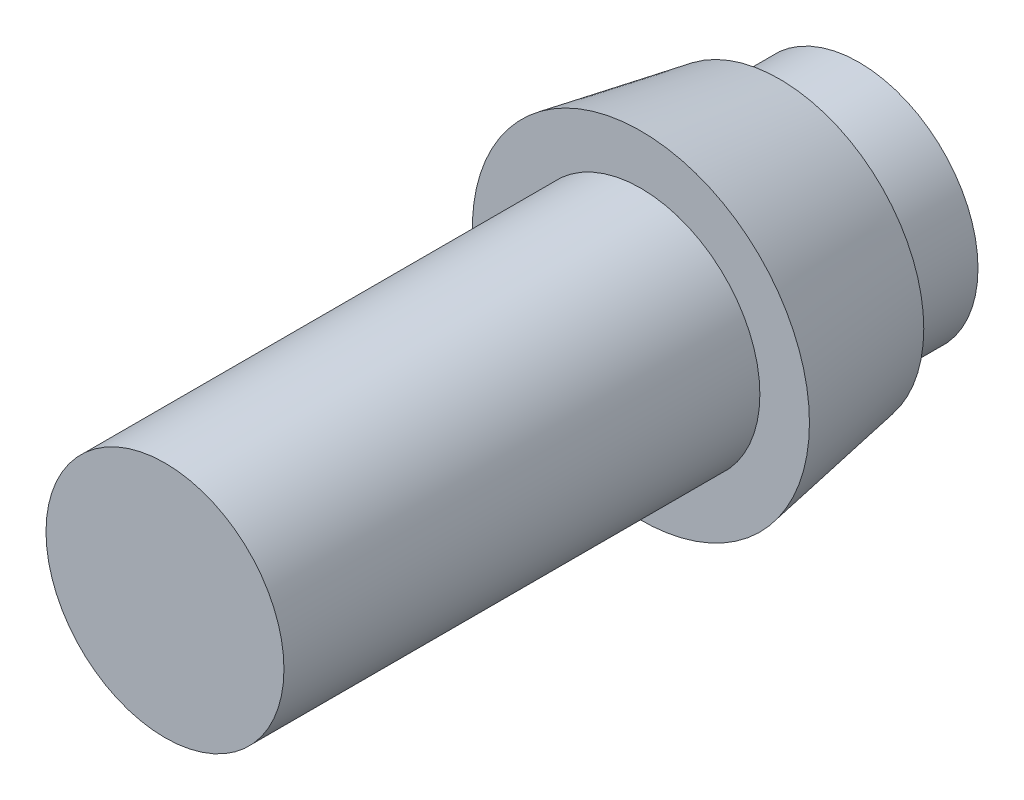
ISO-10303-21;
HEADER;
FILE_DESCRIPTION(('STEP AP214'),'2;1');
FILE_NAME('part.step','',(''),(''),'','','');
FILE_SCHEMA(('AUTOMOTIVE_DESIGN { 1 0 10303 214 1 1 1 1 }'));
ENDSEC;
DATA;
#1=APPLICATION_CONTEXT('core data for automotive mechanical design processes');
#2=APPLICATION_PROTOCOL_DEFINITION('international standard','automotive_design',2000,#1);
#3=PRODUCT_CONTEXT('',#1,'mechanical');
#4=PRODUCT('Part','Part','',(#3));
#5=PRODUCT_RELATED_PRODUCT_CATEGORY('part','',(#4));
#6=PRODUCT_DEFINITION_FORMATION('','',#4);
#7=PRODUCT_DEFINITION_CONTEXT('part definition',#1,'design');
#8=PRODUCT_DEFINITION('design','',#6,#7);
#9=PRODUCT_DEFINITION_SHAPE('','',#8);
#10=(LENGTH_UNIT() NAMED_UNIT(*) SI_UNIT(.MILLI.,.METRE.));
#11=(NAMED_UNIT(*) PLANE_ANGLE_UNIT() SI_UNIT($,.RADIAN.));
#12=(NAMED_UNIT(*) SI_UNIT($,.STERADIAN.) SOLID_ANGLE_UNIT());
#13=UNCERTAINTY_MEASURE_WITH_UNIT(LENGTH_MEASURE(1.E-05),#10,'distance_accuracy_value','');
#14=(GEOMETRIC_REPRESENTATION_CONTEXT(3) GLOBAL_UNCERTAINTY_ASSIGNED_CONTEXT((#13)) GLOBAL_UNIT_ASSIGNED_CONTEXT((#10,
#11,#12)) REPRESENTATION_CONTEXT('',''));
#15=CARTESIAN_POINT('',(0.,0.,0.));
#16=DIRECTION('',(0.,0.,1.));
#17=DIRECTION('',(1.,0.,0.));
#18=AXIS2_PLACEMENT_3D('',#15,#16,#17);
#19=CARTESIAN_POINT('',(0.,0.,24.));
#20=DIRECTION('',(0.,0.,-1.));
#21=DIRECTION('',(-1.,0.,0.));
#22=AXIS2_PLACEMENT_3D('',#19,#20,#21);
#23=CYLINDRICAL_SURFACE('',#22,6.);
#24=CARTESIAN_POINT('',(0.,0.,24.));
#25=DIRECTION('',(0.,0.,1.));
#26=DIRECTION('',(1.,0.,0.));
#27=AXIS2_PLACEMENT_3D('',#24,#25,#26);
#28=CIRCLE('',#27,6.);
#29=CARTESIAN_POINT('',(6.,0.,24.));
#30=VERTEX_POINT('',#29);
#31=EDGE_CURVE('E10',#30,#30,#28,.T.);
#32=ORIENTED_EDGE('',*,*,#31,.F.);
#33=EDGE_LOOP('',(#32));
#34=FACE_BOUND('',#33,.T.);
#35=CARTESIAN_POINT('',(0.,0.,0.));
#36=DIRECTION('',(0.,0.,1.));
#37=DIRECTION('',(1.,0.,0.));
#38=AXIS2_PLACEMENT_3D('',#35,#36,#37);
#39=CIRCLE('',#38,6.);
#40=CARTESIAN_POINT('',(6.,0.,0.));
#41=VERTEX_POINT('',#40);
#42=EDGE_CURVE('E39',#41,#41,#39,.T.);
#43=ORIENTED_EDGE('',*,*,#42,.T.);
#44=EDGE_LOOP('',(#43));
#45=FACE_BOUND('',#44,.T.);
#46=ADVANCED_FACE('F33',(#34,#45),#23,.T.);
#47=CARTESIAN_POINT('',(0.,0.,24.));
#48=DIRECTION('',(0.,0.,1.));
#49=DIRECTION('',(1.,0.,0.));
#50=AXIS2_PLACEMENT_3D('',#47,#48,#49);
#51=PLANE('',#50);
#52=ORIENTED_EDGE('',*,*,#31,.T.);
#53=EDGE_LOOP('',(#52));
#54=FACE_BOUND('',#53,.T.);
#55=ADVANCED_FACE('F71',(#54),#51,.T.);
#56=CARTESIAN_POINT('',(0.,0.,0.));
#57=DIRECTION('',(0.,0.,1.));
#58=DIRECTION('',(1.,0.,0.));
#59=AXIS2_PLACEMENT_3D('',#56,#57,#58);
#60=CONICAL_SURFACE('',#59,8.5,0.174532925199433);
#61=CARTESIAN_POINT('',(0.,0.,-7.));
#62=DIRECTION('',(0.,0.,1.));
#63=DIRECTION('',(1.,0.,0.));
#64=AXIS2_PLACEMENT_3D('',#61,#62,#63);
#65=CIRCLE('',#64,7.26571113504075);
#66=CARTESIAN_POINT('',(7.26571113504075,0.,-7.));
#67=VERTEX_POINT('',#66);
#68=EDGE_CURVE('E43',#67,#67,#65,.T.);
#69=ORIENTED_EDGE('',*,*,#68,.T.);
#70=EDGE_LOOP('',(#69));
#71=FACE_BOUND('',#70,.T.);
#72=CARTESIAN_POINT('',(0.,0.,0.));
#73=DIRECTION('',(0.,0.,1.));
#74=DIRECTION('',(1.,0.,0.));
#75=AXIS2_PLACEMENT_3D('',#72,#73,#74);
#76=CIRCLE('',#75,8.5);
#77=CARTESIAN_POINT('',(8.5,0.,0.));
#78=VERTEX_POINT('',#77);
#79=EDGE_CURVE('E47',#78,#78,#76,.T.);
#80=ORIENTED_EDGE('',*,*,#79,.F.);
#81=EDGE_LOOP('',(#80));
#82=FACE_BOUND('',#81,.T.);
#83=ADVANCED_FACE('F76',(#71,#82),#60,.T.);
#84=CARTESIAN_POINT('',(0.,0.,-7.));
#85=DIRECTION('',(0.,0.,1.));
#86=DIRECTION('',(1.,0.,0.));
#87=AXIS2_PLACEMENT_3D('',#84,#85,#86);
#88=PLANE('',#87);
#89=CARTESIAN_POINT('',(0.,0.,-7.));
#90=DIRECTION('',(0.,0.,1.));
#91=DIRECTION('',(1.,0.,0.));
#92=AXIS2_PLACEMENT_3D('',#89,#90,#91);
#93=CIRCLE('',#92,6.);
#94=CARTESIAN_POINT('',(6.,0.,-7.));
#95=VERTEX_POINT('',#94);
#96=EDGE_CURVE('E53',#95,#95,#93,.T.);
#97=ORIENTED_EDGE('',*,*,#96,.T.);
#98=EDGE_LOOP('',(#97));
#99=FACE_BOUND('',#98,.T.);
#100=ORIENTED_EDGE('',*,*,#68,.F.);
#101=EDGE_LOOP('',(#100));
#102=FACE_BOUND('',#101,.T.);
#103=ADVANCED_FACE('F80',(#99,#102),#88,.F.);
#104=CARTESIAN_POINT('',(0.,0.,0.));
#105=DIRECTION('',(0.,0.,1.));
#106=DIRECTION('',(1.,0.,0.));
#107=AXIS2_PLACEMENT_3D('',#104,#105,#106);
#108=PLANE('',#107);
#109=ORIENTED_EDGE('',*,*,#42,.F.);
#110=EDGE_LOOP('',(#109));
#111=FACE_BOUND('',#110,.T.);
#112=ORIENTED_EDGE('',*,*,#79,.T.);
#113=EDGE_LOOP('',(#112));
#114=FACE_BOUND('',#113,.T.);
#115=ADVANCED_FACE('F68',(#111,#114),#108,.T.);
#116=CARTESIAN_POINT('',(0.,0.,-11.));
#117=DIRECTION('',(0.,0.,1.));
#118=DIRECTION('',(1.,0.,0.));
#119=AXIS2_PLACEMENT_3D('',#116,#117,#118);
#120=CYLINDRICAL_SURFACE('',#119,6.);
#121=CARTESIAN_POINT('',(0.,0.,-11.));
#122=DIRECTION('',(0.,0.,1.));
#123=DIRECTION('',(1.,0.,0.));
#124=AXIS2_PLACEMENT_3D('',#121,#122,#123);
#125=CIRCLE('',#124,6.);
#126=CARTESIAN_POINT('',(6.,0.,-11.));
#127=VERTEX_POINT('',#126);
#128=EDGE_CURVE('E52',#127,#127,#125,.T.);
#129=ORIENTED_EDGE('',*,*,#128,.T.);
#130=EDGE_LOOP('',(#129));
#131=FACE_BOUND('',#130,.T.);
#132=ORIENTED_EDGE('',*,*,#96,.F.);
#133=EDGE_LOOP('',(#132));
#134=FACE_BOUND('',#133,.T.);
#135=ADVANCED_FACE('F59',(#131,#134),#120,.T.);
#136=CARTESIAN_POINT('',(0.,0.,-11.));
#137=DIRECTION('',(0.,0.,1.));
#138=DIRECTION('',(1.,0.,0.));
#139=AXIS2_PLACEMENT_3D('',#136,#137,#138);
#140=PLANE('',#139);
#141=ORIENTED_EDGE('',*,*,#128,.F.);
#142=EDGE_LOOP('',(#141));
#143=FACE_BOUND('',#142,.T.);
#144=ADVANCED_FACE('F62',(#143),#140,.F.);
#145=CLOSED_SHELL('',(#46,#55,#83,#103,#115,#135,#144));
#146=MANIFOLD_SOLID_BREP('B2',#145);
#147=ADVANCED_BREP_SHAPE_REPRESENTATION('',(#18,#146),#14);
#148=SHAPE_DEFINITION_REPRESENTATION(#9,#147);
ENDSEC;
END-ISO-10303-21;
